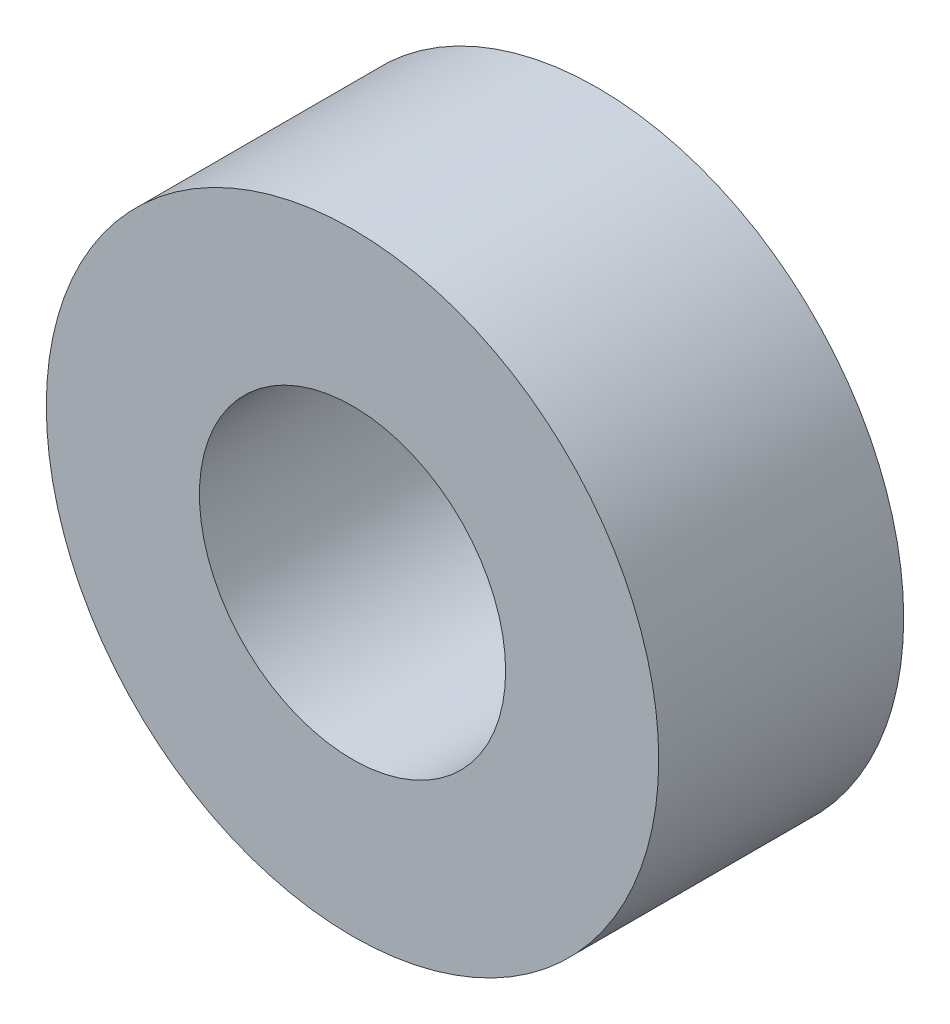
ISO-10303-21;
HEADER;
FILE_DESCRIPTION(('STEP AP214'),'2;1');
FILE_NAME('part.step','',(''),(''),'','','');
FILE_SCHEMA(('AUTOMOTIVE_DESIGN { 1 0 10303 214 1 1 1 1 }'));
ENDSEC;
DATA;
#1=APPLICATION_CONTEXT('core data for automotive mechanical design processes');
#2=APPLICATION_PROTOCOL_DEFINITION('international standard','automotive_design',2000,#1);
#3=PRODUCT_CONTEXT('',#1,'mechanical');
#4=PRODUCT('Part','Part','',(#3));
#5=PRODUCT_RELATED_PRODUCT_CATEGORY('part','',(#4));
#6=PRODUCT_DEFINITION_FORMATION('','',#4);
#7=PRODUCT_DEFINITION_CONTEXT('part definition',#1,'design');
#8=PRODUCT_DEFINITION('design','',#6,#7);
#9=PRODUCT_DEFINITION_SHAPE('','',#8);
#10=(LENGTH_UNIT() NAMED_UNIT(*) SI_UNIT(.MILLI.,.METRE.));
#11=(NAMED_UNIT(*) PLANE_ANGLE_UNIT() SI_UNIT($,.RADIAN.));
#12=(NAMED_UNIT(*) SI_UNIT($,.STERADIAN.) SOLID_ANGLE_UNIT());
#13=UNCERTAINTY_MEASURE_WITH_UNIT(LENGTH_MEASURE(1.E-05),#10,'distance_accuracy_value','');
#14=(GEOMETRIC_REPRESENTATION_CONTEXT(3) GLOBAL_UNCERTAINTY_ASSIGNED_CONTEXT((#13)) GLOBAL_UNIT_ASSIGNED_CONTEXT((#10,
#11,#12)) REPRESENTATION_CONTEXT('',''));
#15=CARTESIAN_POINT('',(0.,0.,0.));
#16=DIRECTION('',(0.,0.,1.));
#17=DIRECTION('',(1.,0.,0.));
#18=AXIS2_PLACEMENT_3D('',#15,#16,#17);
#19=CARTESIAN_POINT('',(0.,0.,4.));
#20=DIRECTION('',(0.,0.,1.));
#21=DIRECTION('',(1.,0.,0.));
#22=AXIS2_PLACEMENT_3D('',#19,#20,#21);
#23=PLANE('',#22);
#24=CARTESIAN_POINT('',(0.,0.,4.));
#25=DIRECTION('',(0.,0.,1.));
#26=DIRECTION('',(1.,0.,0.));
#27=AXIS2_PLACEMENT_3D('',#24,#25,#26);
#28=CIRCLE('',#27,5.);
#29=CARTESIAN_POINT('',(5.,0.,4.));
#30=VERTEX_POINT('',#29);
#31=EDGE_CURVE('E10',#30,#30,#28,.T.);
#32=ORIENTED_EDGE('',*,*,#31,.T.);
#33=EDGE_LOOP('',(#32));
#34=FACE_BOUND('',#33,.T.);
#35=CARTESIAN_POINT('',(0.,0.,4.));
#36=DIRECTION('',(0.,0.,1.));
#37=DIRECTION('',(1.,0.,0.));
#38=AXIS2_PLACEMENT_3D('',#35,#36,#37);
#39=CIRCLE('',#38,2.5);
#40=CARTESIAN_POINT('',(2.5,0.,4.));
#41=VERTEX_POINT('',#40);
#42=EDGE_CURVE('E45',#41,#41,#39,.T.);
#43=ORIENTED_EDGE('',*,*,#42,.F.);
#44=EDGE_LOOP('',(#43));
#45=FACE_BOUND('',#44,.T.);
#46=ADVANCED_FACE('F34',(#34,#45),#23,.T.);
#47=CARTESIAN_POINT('',(0.,0.,0.));
#48=DIRECTION('',(0.,0.,1.));
#49=DIRECTION('',(1.,0.,0.));
#50=AXIS2_PLACEMENT_3D('',#47,#48,#49);
#51=PLANE('',#50);
#52=CARTESIAN_POINT('',(0.,0.,0.));
#53=DIRECTION('',(0.,0.,1.));
#54=DIRECTION('',(1.,0.,0.));
#55=AXIS2_PLACEMENT_3D('',#52,#53,#54);
#56=CIRCLE('',#55,5.);
#57=CARTESIAN_POINT('',(5.,0.,0.));
#58=VERTEX_POINT('',#57);
#59=EDGE_CURVE('E38',#58,#58,#56,.T.);
#60=ORIENTED_EDGE('',*,*,#59,.F.);
#61=EDGE_LOOP('',(#60));
#62=FACE_BOUND('',#61,.T.);
#63=CARTESIAN_POINT('',(0.,0.,0.));
#64=DIRECTION('',(0.,0.,1.));
#65=DIRECTION('',(1.,0.,0.));
#66=AXIS2_PLACEMENT_3D('',#63,#64,#65);
#67=CIRCLE('',#66,2.5);
#68=CARTESIAN_POINT('',(2.5,0.,0.));
#69=VERTEX_POINT('',#68);
#70=EDGE_CURVE('E47',#69,#69,#67,.T.);
#71=ORIENTED_EDGE('',*,*,#70,.T.);
#72=EDGE_LOOP('',(#71));
#73=FACE_BOUND('',#72,.T.);
#74=ADVANCED_FACE('F57',(#62,#73),#51,.F.);
#75=CARTESIAN_POINT('',(0.,0.,4.));
#76=DIRECTION('',(0.,0.,-1.));
#77=DIRECTION('',(-1.,0.,0.));
#78=AXIS2_PLACEMENT_3D('',#75,#76,#77);
#79=CYLINDRICAL_SURFACE('',#78,5.);
#80=ORIENTED_EDGE('',*,*,#31,.F.);
#81=EDGE_LOOP('',(#80));
#82=FACE_BOUND('',#81,.T.);
#83=ORIENTED_EDGE('',*,*,#59,.T.);
#84=EDGE_LOOP('',(#83));
#85=FACE_BOUND('',#84,.T.);
#86=ADVANCED_FACE('F36',(#82,#85),#79,.T.);
#87=CARTESIAN_POINT('',(0.,0.,4.));
#88=DIRECTION('',(0.,0.,-1.));
#89=DIRECTION('',(-1.,0.,0.));
#90=AXIS2_PLACEMENT_3D('',#87,#88,#89);
#91=CYLINDRICAL_SURFACE('',#90,2.5);
#92=ORIENTED_EDGE('',*,*,#42,.T.);
#93=EDGE_LOOP('',(#92));
#94=FACE_BOUND('',#93,.T.);
#95=ORIENTED_EDGE('',*,*,#70,.F.);
#96=EDGE_LOOP('',(#95));
#97=FACE_BOUND('',#96,.T.);
#98=ADVANCED_FACE('F53',(#94,#97),#91,.F.);
#99=CLOSED_SHELL('',(#46,#74,#86,#98));
#100=MANIFOLD_SOLID_BREP('B2',#99);
#101=ADVANCED_BREP_SHAPE_REPRESENTATION('',(#18,#100),#14);
#102=SHAPE_DEFINITION_REPRESENTATION(#9,#101);
ENDSEC;
END-ISO-10303-21;
